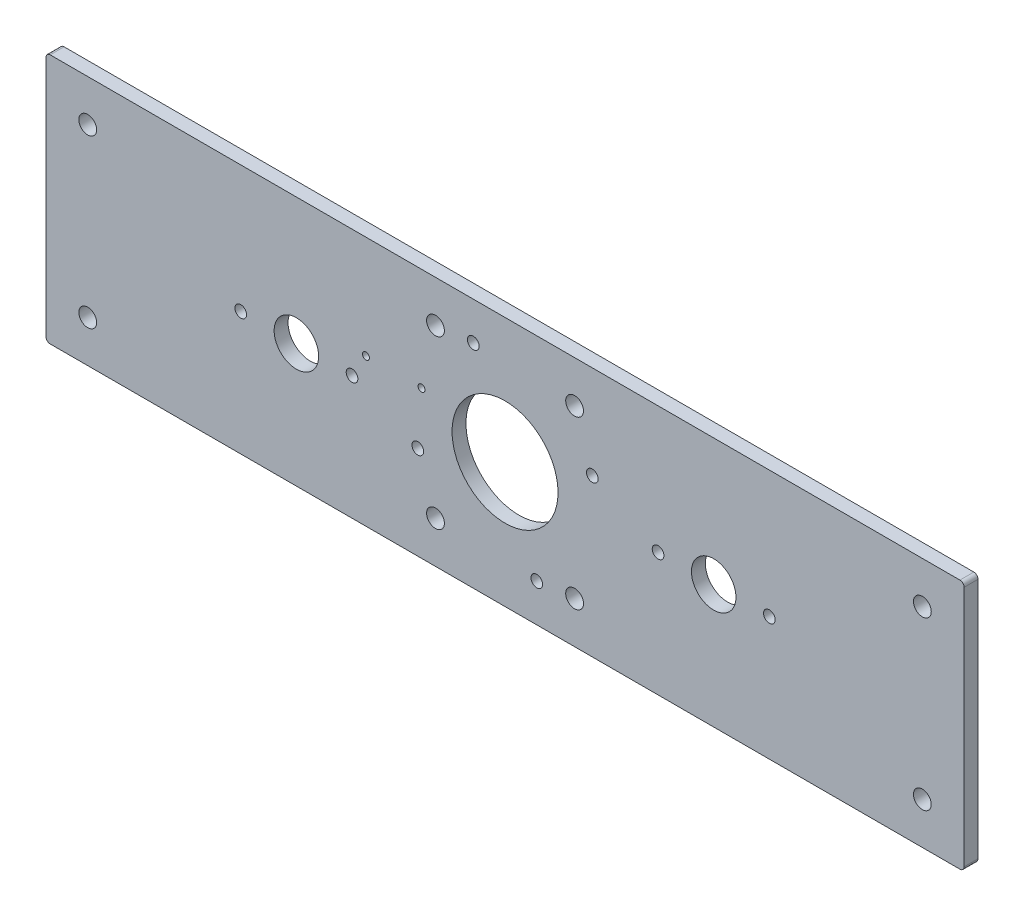
ISO-10303-21;
HEADER;
FILE_DESCRIPTION(('STEP AP214'),'2;1');
FILE_NAME('part.step','',(''),(''),'','','');
FILE_SCHEMA(('AUTOMOTIVE_DESIGN { 1 0 10303 214 1 1 1 1 }'));
ENDSEC;
DATA;
#1=APPLICATION_CONTEXT('core data for automotive mechanical design processes');
#2=APPLICATION_PROTOCOL_DEFINITION('international standard','automotive_design',2000,#1);
#3=PRODUCT_CONTEXT('',#1,'mechanical');
#4=PRODUCT('Part','Part','',(#3));
#5=PRODUCT_RELATED_PRODUCT_CATEGORY('part','',(#4));
#6=PRODUCT_DEFINITION_FORMATION('','',#4);
#7=PRODUCT_DEFINITION_CONTEXT('part definition',#1,'design');
#8=PRODUCT_DEFINITION('design','',#6,#7);
#9=PRODUCT_DEFINITION_SHAPE('','',#8);
#10=(LENGTH_UNIT() NAMED_UNIT(*) SI_UNIT(.MILLI.,.METRE.));
#11=(NAMED_UNIT(*) PLANE_ANGLE_UNIT() SI_UNIT($,.RADIAN.));
#12=(NAMED_UNIT(*) SI_UNIT($,.STERADIAN.) SOLID_ANGLE_UNIT());
#13=UNCERTAINTY_MEASURE_WITH_UNIT(LENGTH_MEASURE(1.E-05),#10,'distance_accuracy_value','');
#14=(GEOMETRIC_REPRESENTATION_CONTEXT(3) GLOBAL_UNCERTAINTY_ASSIGNED_CONTEXT((#13)) GLOBAL_UNIT_ASSIGNED_CONTEXT((#10,
#11,#12)) REPRESENTATION_CONTEXT('',''));
#15=CARTESIAN_POINT('',(0.,0.,0.));
#16=DIRECTION('',(0.,0.,1.));
#17=DIRECTION('',(1.,0.,0.));
#18=AXIS2_PLACEMENT_3D('',#15,#16,#17);
#19=CARTESIAN_POINT('',(0.,0.,2.5));
#20=DIRECTION('',(0.,0.,1.));
#21=DIRECTION('',(1.,0.,0.));
#22=AXIS2_PLACEMENT_3D('',#19,#20,#21);
#23=PLANE('',#22);
#24=CARTESIAN_POINT('',(-50.,8.,2.5));
#25=DIRECTION('',(0.,0.,1.));
#26=DIRECTION('',(1.,0.,0.));
#27=AXIS2_PLACEMENT_3D('',#24,#25,#26);
#28=CIRCLE('',#27,1.24999999999999);
#29=CARTESIAN_POINT('',(-48.75,8.,2.5));
#30=VERTEX_POINT('',#29);
#31=EDGE_CURVE('E300',#30,#30,#28,.T.);
#32=ORIENTED_EDGE('',*,*,#31,.F.);
#33=EDGE_LOOP('',(#32));
#34=FACE_BOUND('',#33,.T.);
#35=CARTESIAN_POINT('',(-30.,8.,2.5));
#36=DIRECTION('',(0.,0.,1.));
#37=DIRECTION('',(1.,0.,0.));
#38=AXIS2_PLACEMENT_3D('',#35,#36,#37);
#39=CIRCLE('',#38,1.24999999999999);
#40=CARTESIAN_POINT('',(-28.75,8.,2.5));
#41=VERTEX_POINT('',#40);
#42=EDGE_CURVE('E294',#41,#41,#39,.T.);
#43=ORIENTED_EDGE('',*,*,#42,.F.);
#44=EDGE_LOOP('',(#43));
#45=FACE_BOUND('',#44,.T.);
#46=CARTESIAN_POINT('',(-11.4150727969836,31.3626547511452,2.5));
#47=DIRECTION('',(0.,0.,1.));
#48=DIRECTION('',(1.,0.,0.));
#49=AXIS2_PLACEMENT_3D('',#46,#47,#48);
#50=CIRCLE('',#49,2.09999999999999);
#51=CARTESIAN_POINT('',(-9.31507279698358,31.3626547511452,2.5));
#52=VERTEX_POINT('',#51);
#53=EDGE_CURVE('E288',#52,#52,#50,.T.);
#54=ORIENTED_EDGE('',*,*,#53,.F.);
#55=EDGE_LOOP('',(#54));
#56=FACE_BOUND('',#55,.T.);
#57=CARTESIAN_POINT('',(11.4150727969856,-31.3626547511456,2.5));
#58=DIRECTION('',(0.,0.,1.));
#59=DIRECTION('',(1.,0.,0.));
#60=AXIS2_PLACEMENT_3D('',#57,#58,#59);
#61=CIRCLE('',#60,2.09999999999999);
#62=CARTESIAN_POINT('',(13.5150727969855,-31.3626547511456,2.5));
#63=VERTEX_POINT('',#62);
#64=EDGE_CURVE('E282',#63,#63,#61,.T.);
#65=ORIENTED_EDGE('',*,*,#64,.F.);
#66=EDGE_LOOP('',(#65));
#67=FACE_BOUND('',#66,.T.);
#68=CARTESIAN_POINT('',(-31.3626547511444,-11.4150727969848,2.5));
#69=DIRECTION('',(0.,0.,1.));
#70=DIRECTION('',(1.,0.,0.));
#71=AXIS2_PLACEMENT_3D('',#68,#69,#70);
#72=CIRCLE('',#71,2.09999999999999);
#73=CARTESIAN_POINT('',(-29.2626547511444,-11.4150727969848,2.5));
#74=VERTEX_POINT('',#73);
#75=EDGE_CURVE('E276',#74,#74,#72,.T.);
#76=ORIENTED_EDGE('',*,*,#75,.F.);
#77=EDGE_LOOP('',(#76));
#78=FACE_BOUND('',#77,.T.);
#79=CARTESIAN_POINT('',(31.3626547511464,11.4150727969844,2.5));
#80=DIRECTION('',(0.,0.,1.));
#81=DIRECTION('',(1.,0.,0.));
#82=AXIS2_PLACEMENT_3D('',#79,#80,#81);
#83=CIRCLE('',#82,2.09999999999998);
#84=CARTESIAN_POINT('',(33.4626547511464,11.4150727969844,2.5));
#85=VERTEX_POINT('',#84);
#86=EDGE_CURVE('E270',#85,#85,#83,.T.);
#87=ORIENTED_EDGE('',*,*,#86,.F.);
#88=EDGE_LOOP('',(#87));
#89=FACE_BOUND('',#88,.T.);
#90=CARTESIAN_POINT('',(95.,-0.600000000000009,2.5));
#91=DIRECTION('',(0.,0.,1.));
#92=DIRECTION('',(1.,0.,0.));
#93=AXIS2_PLACEMENT_3D('',#90,#91,#92);
#94=CIRCLE('',#93,2.09999999999999);
#95=CARTESIAN_POINT('',(97.1,-0.600000000000009,2.5));
#96=VERTEX_POINT('',#95);
#97=EDGE_CURVE('E264',#96,#96,#94,.T.);
#98=ORIENTED_EDGE('',*,*,#97,.F.);
#99=EDGE_LOOP('',(#98));
#100=FACE_BOUND('',#99,.T.);
#101=CARTESIAN_POINT('',(55.,-0.600000000000009,2.5));
#102=DIRECTION('',(0.,0.,1.));
#103=DIRECTION('',(1.,0.,0.));
#104=AXIS2_PLACEMENT_3D('',#101,#102,#103);
#105=CIRCLE('',#104,2.1);
#106=CARTESIAN_POINT('',(57.1,-0.600000000000009,2.5));
#107=VERTEX_POINT('',#106);
#108=EDGE_CURVE('E258',#107,#107,#105,.T.);
#109=ORIENTED_EDGE('',*,*,#108,.F.);
#110=EDGE_LOOP('',(#109));
#111=FACE_BOUND('',#110,.T.);
#112=CARTESIAN_POINT('',(0.,0.,2.5));
#113=DIRECTION('',(0.,0.,1.));
#114=DIRECTION('',(1.,0.,0.));
#115=AXIS2_PLACEMENT_3D('',#112,#113,#114);
#116=CIRCLE('',#115,19.0499999999999);
#117=CARTESIAN_POINT('',(19.0499999999999,0.,2.5));
#118=VERTEX_POINT('',#117);
#119=EDGE_CURVE('E133',#118,#118,#116,.T.);
#120=ORIENTED_EDGE('',*,*,#119,.F.);
#121=EDGE_LOOP('',(#120));
#122=FACE_BOUND('',#121,.T.);
#123=DIRECTION('',(0.,-1.,0.));
#124=VECTOR('',#123,1.);
#125=CARTESIAN_POINT('',(-165.,-45.,2.5));
#126=LINE('',#125,#124);
#127=CARTESIAN_POINT('',(-165.,43.5,2.5));
#128=VERTEX_POINT('',#127);
#129=CARTESIAN_POINT('',(-165.,-43.5,2.5));
#130=VERTEX_POINT('',#129);
#131=EDGE_CURVE('E138',#128,#130,#126,.T.);
#132=ORIENTED_EDGE('',*,*,#131,.T.);
#133=CARTESIAN_POINT('',(-163.5,-43.5,2.5));
#134=DIRECTION('',(0.,0.,1.));
#135=DIRECTION('',(1.,0.,0.));
#136=AXIS2_PLACEMENT_3D('',#133,#134,#135);
#137=CIRCLE('',#136,1.5);
#138=CARTESIAN_POINT('',(-163.5,-45.,2.5));
#139=VERTEX_POINT('',#138);
#140=EDGE_CURVE('E153',#130,#139,#137,.T.);
#141=ORIENTED_EDGE('',*,*,#140,.T.);
#142=DIRECTION('',(1.,0.,0.));
#143=VECTOR('',#142,1.);
#144=CARTESIAN_POINT('',(165.,-45.,2.5));
#145=LINE('',#144,#143);
#146=CARTESIAN_POINT('',(163.5,-45.,2.5));
#147=VERTEX_POINT('',#146);
#148=EDGE_CURVE('E120',#139,#147,#145,.T.);
#149=ORIENTED_EDGE('',*,*,#148,.T.);
#150=CARTESIAN_POINT('',(163.5,-43.5,2.5));
#151=DIRECTION('',(0.,0.,1.));
#152=DIRECTION('',(1.,0.,0.));
#153=AXIS2_PLACEMENT_3D('',#150,#151,#152);
#154=CIRCLE('',#153,1.5);
#155=CARTESIAN_POINT('',(165.,-43.5,2.5));
#156=VERTEX_POINT('',#155);
#157=EDGE_CURVE('E151',#147,#156,#154,.T.);
#158=ORIENTED_EDGE('',*,*,#157,.T.);
#159=DIRECTION('',(0.,1.,0.));
#160=VECTOR('',#159,1.);
#161=CARTESIAN_POINT('',(165.,-45.,2.5));
#162=LINE('',#161,#160);
#163=CARTESIAN_POINT('',(165.,43.5,2.5));
#164=VERTEX_POINT('',#163);
#165=EDGE_CURVE('E164',#156,#164,#162,.T.);
#166=ORIENTED_EDGE('',*,*,#165,.T.);
#167=CARTESIAN_POINT('',(163.5,43.5,2.5));
#168=DIRECTION('',(0.,0.,1.));
#169=DIRECTION('',(1.,0.,0.));
#170=AXIS2_PLACEMENT_3D('',#167,#168,#169);
#171=CIRCLE('',#170,1.5);
#172=CARTESIAN_POINT('',(163.5,45.,2.5));
#173=VERTEX_POINT('',#172);
#174=EDGE_CURVE('E55',#164,#173,#171,.T.);
#175=ORIENTED_EDGE('',*,*,#174,.T.);
#176=DIRECTION('',(-1.,0.,0.));
#177=VECTOR('',#176,1.);
#178=CARTESIAN_POINT('',(165.,45.,2.5));
#179=LINE('',#178,#177);
#180=CARTESIAN_POINT('',(-163.5,45.,2.5));
#181=VERTEX_POINT('',#180);
#182=EDGE_CURVE('E139',#173,#181,#179,.T.);
#183=ORIENTED_EDGE('',*,*,#182,.T.);
#184=CARTESIAN_POINT('',(-163.5,43.5,2.5));
#185=DIRECTION('',(0.,0.,1.));
#186=DIRECTION('',(1.,0.,0.));
#187=AXIS2_PLACEMENT_3D('',#184,#185,#186);
#188=CIRCLE('',#187,1.5);
#189=EDGE_CURVE('E148',#181,#128,#188,.T.);
#190=ORIENTED_EDGE('',*,*,#189,.T.);
#191=EDGE_LOOP('',(#132,#141,#149,#158,#166,#175,#183,#190));
#192=FACE_BOUND('',#191,.T.);
#193=CARTESIAN_POINT('',(-150.,-30.,2.5));
#194=DIRECTION('',(0.,0.,1.));
#195=DIRECTION('',(1.,0.,0.));
#196=AXIS2_PLACEMENT_3D('',#193,#194,#195);
#197=CIRCLE('',#196,3.19999999999998);
#198=CARTESIAN_POINT('',(-146.8,-30.,2.5));
#199=VERTEX_POINT('',#198);
#200=EDGE_CURVE('E186',#199,#199,#197,.T.);
#201=ORIENTED_EDGE('',*,*,#200,.F.);
#202=EDGE_LOOP('',(#201));
#203=FACE_BOUND('',#202,.T.);
#204=CARTESIAN_POINT('',(-25.,-30.,2.5));
#205=DIRECTION('',(0.,0.,1.));
#206=DIRECTION('',(1.,0.,0.));
#207=AXIS2_PLACEMENT_3D('',#204,#205,#206);
#208=CIRCLE('',#207,3.19999999999999);
#209=CARTESIAN_POINT('',(-21.8,-30.,2.5));
#210=VERTEX_POINT('',#209);
#211=EDGE_CURVE('E192',#210,#210,#208,.T.);
#212=ORIENTED_EDGE('',*,*,#211,.F.);
#213=EDGE_LOOP('',(#212));
#214=FACE_BOUND('',#213,.T.);
#215=CARTESIAN_POINT('',(-25.,30.,2.5));
#216=DIRECTION('',(0.,0.,1.));
#217=DIRECTION('',(1.,0.,0.));
#218=AXIS2_PLACEMENT_3D('',#215,#216,#217);
#219=CIRCLE('',#218,3.19999999999999);
#220=CARTESIAN_POINT('',(-21.8,30.,2.5));
#221=VERTEX_POINT('',#220);
#222=EDGE_CURVE('E198',#221,#221,#219,.T.);
#223=ORIENTED_EDGE('',*,*,#222,.F.);
#224=EDGE_LOOP('',(#223));
#225=FACE_BOUND('',#224,.T.);
#226=CARTESIAN_POINT('',(-150.,30.,2.5));
#227=DIRECTION('',(0.,0.,1.));
#228=DIRECTION('',(1.,0.,0.));
#229=AXIS2_PLACEMENT_3D('',#226,#227,#228);
#230=CIRCLE('',#229,3.19999999999998);
#231=CARTESIAN_POINT('',(-146.8,30.,2.5));
#232=VERTEX_POINT('',#231);
#233=EDGE_CURVE('E204',#232,#232,#230,.T.);
#234=ORIENTED_EDGE('',*,*,#233,.F.);
#235=EDGE_LOOP('',(#234));
#236=FACE_BOUND('',#235,.T.);
#237=CARTESIAN_POINT('',(150.,-30.,2.5));
#238=DIRECTION('',(0.,0.,1.));
#239=DIRECTION('',(1.,0.,0.));
#240=AXIS2_PLACEMENT_3D('',#237,#238,#239);
#241=CIRCLE('',#240,3.19999999999998);
#242=CARTESIAN_POINT('',(153.2,-30.,2.5));
#243=VERTEX_POINT('',#242);
#244=EDGE_CURVE('E210',#243,#243,#241,.T.);
#245=ORIENTED_EDGE('',*,*,#244,.F.);
#246=EDGE_LOOP('',(#245));
#247=FACE_BOUND('',#246,.T.);
#248=CARTESIAN_POINT('',(25.,-30.,2.5));
#249=DIRECTION('',(0.,0.,1.));
#250=DIRECTION('',(1.,0.,0.));
#251=AXIS2_PLACEMENT_3D('',#248,#249,#250);
#252=CIRCLE('',#251,3.19999999999999);
#253=CARTESIAN_POINT('',(28.2,-30.,2.5));
#254=VERTEX_POINT('',#253);
#255=EDGE_CURVE('E216',#254,#254,#252,.T.);
#256=ORIENTED_EDGE('',*,*,#255,.F.);
#257=EDGE_LOOP('',(#256));
#258=FACE_BOUND('',#257,.T.);
#259=CARTESIAN_POINT('',(25.,30.,2.5));
#260=DIRECTION('',(0.,0.,1.));
#261=DIRECTION('',(1.,0.,0.));
#262=AXIS2_PLACEMENT_3D('',#259,#260,#261);
#263=CIRCLE('',#262,3.19999999999999);
#264=CARTESIAN_POINT('',(28.2,30.,2.5));
#265=VERTEX_POINT('',#264);
#266=EDGE_CURVE('E222',#265,#265,#263,.T.);
#267=ORIENTED_EDGE('',*,*,#266,.F.);
#268=EDGE_LOOP('',(#267));
#269=FACE_BOUND('',#268,.T.);
#270=CARTESIAN_POINT('',(150.,30.,2.5));
#271=DIRECTION('',(0.,0.,1.));
#272=DIRECTION('',(1.,0.,0.));
#273=AXIS2_PLACEMENT_3D('',#270,#271,#272);
#274=CIRCLE('',#273,3.19999999999998);
#275=CARTESIAN_POINT('',(153.2,30.,2.5));
#276=VERTEX_POINT('',#275);
#277=EDGE_CURVE('E228',#276,#276,#274,.T.);
#278=ORIENTED_EDGE('',*,*,#277,.F.);
#279=EDGE_LOOP('',(#278));
#280=FACE_BOUND('',#279,.T.);
#281=CARTESIAN_POINT('',(-75.,-0.600000000000009,2.5));
#282=DIRECTION('',(0.,0.,1.));
#283=DIRECTION('',(1.,0.,0.));
#284=AXIS2_PLACEMENT_3D('',#281,#282,#283);
#285=CIRCLE('',#284,8.);
#286=CARTESIAN_POINT('',(-67.,-0.600000000000009,2.5));
#287=VERTEX_POINT('',#286);
#288=EDGE_CURVE('E232',#287,#287,#285,.T.);
#289=ORIENTED_EDGE('',*,*,#288,.F.);
#290=EDGE_LOOP('',(#289));
#291=FACE_BOUND('',#290,.T.);
#292=CARTESIAN_POINT('',(-55.,-0.600000000000009,2.5));
#293=DIRECTION('',(0.,0.,1.));
#294=DIRECTION('',(1.,0.,0.));
#295=AXIS2_PLACEMENT_3D('',#292,#293,#294);
#296=CIRCLE('',#295,2.1);
#297=CARTESIAN_POINT('',(-52.9,-0.600000000000009,2.5));
#298=VERTEX_POINT('',#297);
#299=EDGE_CURVE('E240',#298,#298,#296,.T.);
#300=ORIENTED_EDGE('',*,*,#299,.F.);
#301=EDGE_LOOP('',(#300));
#302=FACE_BOUND('',#301,.T.);
#303=CARTESIAN_POINT('',(-95.,-0.600000000000009,2.5));
#304=DIRECTION('',(0.,0.,1.));
#305=DIRECTION('',(1.,0.,0.));
#306=AXIS2_PLACEMENT_3D('',#303,#304,#305);
#307=CIRCLE('',#306,2.09999999999999);
#308=CARTESIAN_POINT('',(-92.9,-0.600000000000009,2.5));
#309=VERTEX_POINT('',#308);
#310=EDGE_CURVE('E246',#309,#309,#307,.T.);
#311=ORIENTED_EDGE('',*,*,#310,.F.);
#312=EDGE_LOOP('',(#311));
#313=FACE_BOUND('',#312,.T.);
#314=CARTESIAN_POINT('',(75.,-0.600000000000009,2.5));
#315=DIRECTION('',(0.,0.,-1.));
#316=DIRECTION('',(-1.,0.,0.));
#317=AXIS2_PLACEMENT_3D('',#314,#315,#316);
#318=CIRCLE('',#317,8.);
#319=CARTESIAN_POINT('',(67.,-0.600000000000009,2.5));
#320=VERTEX_POINT('',#319);
#321=EDGE_CURVE('E250',#320,#320,#318,.T.);
#322=ORIENTED_EDGE('',*,*,#321,.T.);
#323=EDGE_LOOP('',(#322));
#324=FACE_BOUND('',#323,.T.);
#325=ADVANCED_FACE('F34',(#34,#45,#56,#67,#78,#89,#100,#111,#122,#192,#203,#214,#225,#236,#247,
#258,#269,#280,#291,#302,#313,#324),#23,.T.);
#326=CARTESIAN_POINT('',(0.,0.,-2.5));
#327=DIRECTION('',(0.,0.,1.));
#328=DIRECTION('',(1.,0.,0.));
#329=AXIS2_PLACEMENT_3D('',#326,#327,#328);
#330=PLANE('',#329);
#331=CARTESIAN_POINT('',(-50.,8.,-2.5));
#332=DIRECTION('',(0.,0.,1.));
#333=DIRECTION('',(1.,0.,0.));
#334=AXIS2_PLACEMENT_3D('',#331,#332,#333);
#335=CIRCLE('',#334,1.25);
#336=CARTESIAN_POINT('',(-48.75,8.,-2.5));
#337=VERTEX_POINT('',#336);
#338=EDGE_CURVE('E297',#337,#337,#335,.T.);
#339=ORIENTED_EDGE('',*,*,#338,.T.);
#340=EDGE_LOOP('',(#339));
#341=FACE_BOUND('',#340,.T.);
#342=CARTESIAN_POINT('',(-30.,8.,-2.5));
#343=DIRECTION('',(0.,0.,1.));
#344=DIRECTION('',(1.,0.,0.));
#345=AXIS2_PLACEMENT_3D('',#342,#343,#344);
#346=CIRCLE('',#345,1.25);
#347=CARTESIAN_POINT('',(-28.75,8.,-2.5));
#348=VERTEX_POINT('',#347);
#349=EDGE_CURVE('E291',#348,#348,#346,.T.);
#350=ORIENTED_EDGE('',*,*,#349,.T.);
#351=EDGE_LOOP('',(#350));
#352=FACE_BOUND('',#351,.T.);
#353=CARTESIAN_POINT('',(-11.4150727969836,31.3626547511452,-2.5));
#354=DIRECTION('',(0.,0.,1.));
#355=DIRECTION('',(1.,0.,0.));
#356=AXIS2_PLACEMENT_3D('',#353,#354,#355);
#357=CIRCLE('',#356,2.1);
#358=CARTESIAN_POINT('',(-9.31507279698357,31.3626547511452,-2.5));
#359=VERTEX_POINT('',#358);
#360=EDGE_CURVE('E285',#359,#359,#357,.T.);
#361=ORIENTED_EDGE('',*,*,#360,.T.);
#362=EDGE_LOOP('',(#361));
#363=FACE_BOUND('',#362,.T.);
#364=CARTESIAN_POINT('',(11.4150727969856,-31.3626547511456,-2.5));
#365=DIRECTION('',(0.,0.,1.));
#366=DIRECTION('',(1.,0.,0.));
#367=AXIS2_PLACEMENT_3D('',#364,#365,#366);
#368=CIRCLE('',#367,2.1);
#369=CARTESIAN_POINT('',(13.5150727969856,-31.3626547511456,-2.5));
#370=VERTEX_POINT('',#369);
#371=EDGE_CURVE('E279',#370,#370,#368,.T.);
#372=ORIENTED_EDGE('',*,*,#371,.T.);
#373=EDGE_LOOP('',(#372));
#374=FACE_BOUND('',#373,.T.);
#375=CARTESIAN_POINT('',(-31.3626547511444,-11.4150727969848,-2.5));
#376=DIRECTION('',(0.,0.,1.));
#377=DIRECTION('',(1.,0.,0.));
#378=AXIS2_PLACEMENT_3D('',#375,#376,#377);
#379=CIRCLE('',#378,2.1);
#380=CARTESIAN_POINT('',(-29.2626547511444,-11.4150727969848,-2.5));
#381=VERTEX_POINT('',#380);
#382=EDGE_CURVE('E273',#381,#381,#379,.T.);
#383=ORIENTED_EDGE('',*,*,#382,.T.);
#384=EDGE_LOOP('',(#383));
#385=FACE_BOUND('',#384,.T.);
#386=CARTESIAN_POINT('',(31.3626547511464,11.4150727969844,-2.5));
#387=DIRECTION('',(0.,0.,1.));
#388=DIRECTION('',(1.,0.,0.));
#389=AXIS2_PLACEMENT_3D('',#386,#387,#388);
#390=CIRCLE('',#389,2.1);
#391=CARTESIAN_POINT('',(33.4626547511464,11.4150727969844,-2.5));
#392=VERTEX_POINT('',#391);
#393=EDGE_CURVE('E267',#392,#392,#390,.T.);
#394=ORIENTED_EDGE('',*,*,#393,.T.);
#395=EDGE_LOOP('',(#394));
#396=FACE_BOUND('',#395,.T.);
#397=CARTESIAN_POINT('',(95.,-0.600000000000009,-2.5));
#398=DIRECTION('',(0.,0.,1.));
#399=DIRECTION('',(1.,0.,0.));
#400=AXIS2_PLACEMENT_3D('',#397,#398,#399);
#401=CIRCLE('',#400,2.09999999999999);
#402=CARTESIAN_POINT('',(97.1,-0.600000000000009,-2.5));
#403=VERTEX_POINT('',#402);
#404=EDGE_CURVE('E261',#403,#403,#401,.T.);
#405=ORIENTED_EDGE('',*,*,#404,.T.);
#406=EDGE_LOOP('',(#405));
#407=FACE_BOUND('',#406,.T.);
#408=CARTESIAN_POINT('',(55.,-0.600000000000009,-2.5));
#409=DIRECTION('',(0.,0.,1.));
#410=DIRECTION('',(1.,0.,0.));
#411=AXIS2_PLACEMENT_3D('',#408,#409,#410);
#412=CIRCLE('',#411,2.1);
#413=CARTESIAN_POINT('',(57.1,-0.600000000000009,-2.5));
#414=VERTEX_POINT('',#413);
#415=EDGE_CURVE('E253',#414,#414,#412,.T.);
#416=ORIENTED_EDGE('',*,*,#415,.T.);
#417=EDGE_LOOP('',(#416));
#418=FACE_BOUND('',#417,.T.);
#419=CARTESIAN_POINT('',(0.,0.,-2.5));
#420=DIRECTION('',(0.,0.,1.));
#421=DIRECTION('',(1.,0.,0.));
#422=AXIS2_PLACEMENT_3D('',#419,#420,#421);
#423=CIRCLE('',#422,19.0499999999999);
#424=CARTESIAN_POINT('',(19.0499999999999,0.,-2.5));
#425=VERTEX_POINT('',#424);
#426=EDGE_CURVE('E178',#425,#425,#423,.T.);
#427=ORIENTED_EDGE('',*,*,#426,.T.);
#428=EDGE_LOOP('',(#427));
#429=FACE_BOUND('',#428,.T.);
#430=DIRECTION('',(1.,0.,0.));
#431=VECTOR('',#430,1.);
#432=CARTESIAN_POINT('',(165.,-45.,-2.5));
#433=LINE('',#432,#431);
#434=CARTESIAN_POINT('',(-163.5,-45.,-2.5));
#435=VERTEX_POINT('',#434);
#436=CARTESIAN_POINT('',(163.5,-45.,-2.5));
#437=VERTEX_POINT('',#436);
#438=EDGE_CURVE('E117',#435,#437,#433,.T.);
#439=ORIENTED_EDGE('',*,*,#438,.F.);
#440=CARTESIAN_POINT('',(-163.5,-43.5,-2.5));
#441=DIRECTION('',(0.,0.,1.));
#442=DIRECTION('',(1.,0.,0.));
#443=AXIS2_PLACEMENT_3D('',#440,#441,#442);
#444=CIRCLE('',#443,1.5);
#445=CARTESIAN_POINT('',(-165.,-43.5,-2.5));
#446=VERTEX_POINT('',#445);
#447=EDGE_CURVE('E100',#435,#446,#444,.F.);
#448=ORIENTED_EDGE('',*,*,#447,.T.);
#449=DIRECTION('',(0.,-1.,0.));
#450=VECTOR('',#449,1.);
#451=CARTESIAN_POINT('',(-165.,-45.,-2.5));
#452=LINE('',#451,#450);
#453=CARTESIAN_POINT('',(-165.,43.5,-2.5));
#454=VERTEX_POINT('',#453);
#455=EDGE_CURVE('E128',#454,#446,#452,.T.);
#456=ORIENTED_EDGE('',*,*,#455,.F.);
#457=CARTESIAN_POINT('',(-163.5,43.5,-2.5));
#458=DIRECTION('',(0.,0.,1.));
#459=DIRECTION('',(1.,0.,0.));
#460=AXIS2_PLACEMENT_3D('',#457,#458,#459);
#461=CIRCLE('',#460,1.5);
#462=CARTESIAN_POINT('',(-163.5,45.,-2.5));
#463=VERTEX_POINT('',#462);
#464=EDGE_CURVE('E121',#454,#463,#461,.F.);
#465=ORIENTED_EDGE('',*,*,#464,.T.);
#466=DIRECTION('',(-1.,0.,0.));
#467=VECTOR('',#466,1.);
#468=CARTESIAN_POINT('',(165.,45.,-2.5));
#469=LINE('',#468,#467);
#470=CARTESIAN_POINT('',(163.5,45.,-2.5));
#471=VERTEX_POINT('',#470);
#472=EDGE_CURVE('E131',#471,#463,#469,.T.);
#473=ORIENTED_EDGE('',*,*,#472,.F.);
#474=CARTESIAN_POINT('',(163.5,43.5,-2.5));
#475=DIRECTION('',(0.,0.,1.));
#476=DIRECTION('',(1.,0.,0.));
#477=AXIS2_PLACEMENT_3D('',#474,#475,#476);
#478=CIRCLE('',#477,1.5);
#479=CARTESIAN_POINT('',(165.,43.5,-2.5));
#480=VERTEX_POINT('',#479);
#481=EDGE_CURVE('E142',#471,#480,#478,.F.);
#482=ORIENTED_EDGE('',*,*,#481,.T.);
#483=DIRECTION('',(0.,1.,0.));
#484=VECTOR('',#483,1.);
#485=CARTESIAN_POINT('',(165.,-45.,-2.5));
#486=LINE('',#485,#484);
#487=CARTESIAN_POINT('',(165.,-43.5,-2.5));
#488=VERTEX_POINT('',#487);
#489=EDGE_CURVE('E127',#488,#480,#486,.T.);
#490=ORIENTED_EDGE('',*,*,#489,.F.);
#491=CARTESIAN_POINT('',(163.5,-43.5,-2.5));
#492=DIRECTION('',(0.,0.,1.));
#493=DIRECTION('',(1.,0.,0.));
#494=AXIS2_PLACEMENT_3D('',#491,#492,#493);
#495=CIRCLE('',#494,1.5);
#496=EDGE_CURVE('E111',#488,#437,#495,.F.);
#497=ORIENTED_EDGE('',*,*,#496,.T.);
#498=EDGE_LOOP('',(#439,#448,#456,#465,#473,#482,#490,#497));
#499=FACE_BOUND('',#498,.T.);
#500=CARTESIAN_POINT('',(-150.,-30.,-2.5));
#501=DIRECTION('',(0.,0.,1.));
#502=DIRECTION('',(1.,0.,0.));
#503=AXIS2_PLACEMENT_3D('',#500,#501,#502);
#504=CIRCLE('',#503,3.20000000000001);
#505=CARTESIAN_POINT('',(-146.8,-30.,-2.5));
#506=VERTEX_POINT('',#505);
#507=EDGE_CURVE('E181',#506,#506,#504,.T.);
#508=ORIENTED_EDGE('',*,*,#507,.T.);
#509=EDGE_LOOP('',(#508));
#510=FACE_BOUND('',#509,.T.);
#511=CARTESIAN_POINT('',(-25.,-30.,-2.5));
#512=DIRECTION('',(0.,0.,1.));
#513=DIRECTION('',(1.,0.,0.));
#514=AXIS2_PLACEMENT_3D('',#511,#512,#513);
#515=CIRCLE('',#514,3.2);
#516=CARTESIAN_POINT('',(-21.8,-30.,-2.5));
#517=VERTEX_POINT('',#516);
#518=EDGE_CURVE('E189',#517,#517,#515,.T.);
#519=ORIENTED_EDGE('',*,*,#518,.T.);
#520=EDGE_LOOP('',(#519));
#521=FACE_BOUND('',#520,.T.);
#522=CARTESIAN_POINT('',(-25.,30.,-2.5));
#523=DIRECTION('',(0.,0.,1.));
#524=DIRECTION('',(1.,0.,0.));
#525=AXIS2_PLACEMENT_3D('',#522,#523,#524);
#526=CIRCLE('',#525,3.2);
#527=CARTESIAN_POINT('',(-21.8,30.,-2.5));
#528=VERTEX_POINT('',#527);
#529=EDGE_CURVE('E195',#528,#528,#526,.T.);
#530=ORIENTED_EDGE('',*,*,#529,.T.);
#531=EDGE_LOOP('',(#530));
#532=FACE_BOUND('',#531,.T.);
#533=CARTESIAN_POINT('',(-150.,30.,-2.5));
#534=DIRECTION('',(0.,0.,1.));
#535=DIRECTION('',(1.,0.,0.));
#536=AXIS2_PLACEMENT_3D('',#533,#534,#535);
#537=CIRCLE('',#536,3.20000000000001);
#538=CARTESIAN_POINT('',(-146.8,30.,-2.5));
#539=VERTEX_POINT('',#538);
#540=EDGE_CURVE('E201',#539,#539,#537,.T.);
#541=ORIENTED_EDGE('',*,*,#540,.T.);
#542=EDGE_LOOP('',(#541));
#543=FACE_BOUND('',#542,.T.);
#544=CARTESIAN_POINT('',(150.,-30.,-2.5));
#545=DIRECTION('',(0.,0.,1.));
#546=DIRECTION('',(1.,0.,0.));
#547=AXIS2_PLACEMENT_3D('',#544,#545,#546);
#548=CIRCLE('',#547,3.20000000000001);
#549=CARTESIAN_POINT('',(153.2,-30.,-2.5));
#550=VERTEX_POINT('',#549);
#551=EDGE_CURVE('E207',#550,#550,#548,.T.);
#552=ORIENTED_EDGE('',*,*,#551,.T.);
#553=EDGE_LOOP('',(#552));
#554=FACE_BOUND('',#553,.T.);
#555=CARTESIAN_POINT('',(25.,-30.,-2.5));
#556=DIRECTION('',(0.,0.,1.));
#557=DIRECTION('',(1.,0.,0.));
#558=AXIS2_PLACEMENT_3D('',#555,#556,#557);
#559=CIRCLE('',#558,3.2);
#560=CARTESIAN_POINT('',(28.2,-30.,-2.5));
#561=VERTEX_POINT('',#560);
#562=EDGE_CURVE('E213',#561,#561,#559,.T.);
#563=ORIENTED_EDGE('',*,*,#562,.T.);
#564=EDGE_LOOP('',(#563));
#565=FACE_BOUND('',#564,.T.);
#566=CARTESIAN_POINT('',(25.,30.,-2.5));
#567=DIRECTION('',(0.,0.,1.));
#568=DIRECTION('',(1.,0.,0.));
#569=AXIS2_PLACEMENT_3D('',#566,#567,#568);
#570=CIRCLE('',#569,3.2);
#571=CARTESIAN_POINT('',(28.2,30.,-2.5));
#572=VERTEX_POINT('',#571);
#573=EDGE_CURVE('E219',#572,#572,#570,.T.);
#574=ORIENTED_EDGE('',*,*,#573,.T.);
#575=EDGE_LOOP('',(#574));
#576=FACE_BOUND('',#575,.T.);
#577=CARTESIAN_POINT('',(150.,30.,-2.5));
#578=DIRECTION('',(0.,0.,1.));
#579=DIRECTION('',(1.,0.,0.));
#580=AXIS2_PLACEMENT_3D('',#577,#578,#579);
#581=CIRCLE('',#580,3.20000000000001);
#582=CARTESIAN_POINT('',(153.2,30.,-2.5));
#583=VERTEX_POINT('',#582);
#584=EDGE_CURVE('E225',#583,#583,#581,.T.);
#585=ORIENTED_EDGE('',*,*,#584,.T.);
#586=EDGE_LOOP('',(#585));
#587=FACE_BOUND('',#586,.T.);
#588=CARTESIAN_POINT('',(-75.,-0.600000000000009,-2.5));
#589=DIRECTION('',(0.,0.,1.));
#590=DIRECTION('',(1.,0.,0.));
#591=AXIS2_PLACEMENT_3D('',#588,#589,#590);
#592=CIRCLE('',#591,8.);
#593=CARTESIAN_POINT('',(-67.,-0.600000000000009,-2.5));
#594=VERTEX_POINT('',#593);
#595=EDGE_CURVE('E231',#594,#594,#592,.T.);
#596=ORIENTED_EDGE('',*,*,#595,.T.);
#597=EDGE_LOOP('',(#596));
#598=FACE_BOUND('',#597,.T.);
#599=CARTESIAN_POINT('',(-55.,-0.600000000000009,-2.5));
#600=DIRECTION('',(0.,0.,1.));
#601=DIRECTION('',(1.,0.,0.));
#602=AXIS2_PLACEMENT_3D('',#599,#600,#601);
#603=CIRCLE('',#602,2.1);
#604=CARTESIAN_POINT('',(-52.9,-0.600000000000009,-2.5));
#605=VERTEX_POINT('',#604);
#606=EDGE_CURVE('E235',#605,#605,#603,.T.);
#607=ORIENTED_EDGE('',*,*,#606,.T.);
#608=EDGE_LOOP('',(#607));
#609=FACE_BOUND('',#608,.T.);
#610=CARTESIAN_POINT('',(-95.,-0.600000000000009,-2.5));
#611=DIRECTION('',(0.,0.,1.));
#612=DIRECTION('',(1.,0.,0.));
#613=AXIS2_PLACEMENT_3D('',#610,#611,#612);
#614=CIRCLE('',#613,2.09999999999999);
#615=CARTESIAN_POINT('',(-92.9,-0.600000000000009,-2.5));
#616=VERTEX_POINT('',#615);
#617=EDGE_CURVE('E243',#616,#616,#614,.T.);
#618=ORIENTED_EDGE('',*,*,#617,.T.);
#619=EDGE_LOOP('',(#618));
#620=FACE_BOUND('',#619,.T.);
#621=CARTESIAN_POINT('',(75.,-0.600000000000009,-2.5));
#622=DIRECTION('',(0.,0.,-1.));
#623=DIRECTION('',(-1.,0.,0.));
#624=AXIS2_PLACEMENT_3D('',#621,#622,#623);
#625=CIRCLE('',#624,8.);
#626=CARTESIAN_POINT('',(67.,-0.600000000000009,-2.5));
#627=VERTEX_POINT('',#626);
#628=EDGE_CURVE('E249',#627,#627,#625,.T.);
#629=ORIENTED_EDGE('',*,*,#628,.F.);
#630=EDGE_LOOP('',(#629));
#631=FACE_BOUND('',#630,.T.);
#632=ADVANCED_FACE('F124',(#341,#352,#363,#374,#385,#396,#407,#418,#429,#499,#510,#521,#532,
#543,#554,#565,#576,#587,#598,#609,#620,#631),#330,.F.);
#633=CARTESIAN_POINT('',(-165.,-45.,2.5));
#634=DIRECTION('',(1.,0.,0.));
#635=DIRECTION('',(0.,0.,-1.));
#636=AXIS2_PLACEMENT_3D('',#633,#634,#635);
#637=PLANE('',#636);
#638=ORIENTED_EDGE('',*,*,#455,.T.);
#639=DIRECTION('',(0.,0.,-1.));
#640=VECTOR('',#639,1.);
#641=CARTESIAN_POINT('',(-165.,-43.5,2.5));
#642=LINE('',#641,#640);
#643=EDGE_CURVE('E105',#446,#130,#642,.F.);
#644=ORIENTED_EDGE('',*,*,#643,.T.);
#645=ORIENTED_EDGE('',*,*,#131,.F.);
#646=DIRECTION('',(0.,0.,-1.));
#647=VECTOR('',#646,1.);
#648=CARTESIAN_POINT('',(-165.,43.5,2.5));
#649=LINE('',#648,#647);
#650=EDGE_CURVE('E110',#128,#454,#649,.T.);
#651=ORIENTED_EDGE('',*,*,#650,.T.);
#652=EDGE_LOOP('',(#638,#644,#645,#651));
#653=FACE_BOUND('',#652,.T.);
#654=ADVANCED_FACE('F413',(#653),#637,.F.);
#655=CARTESIAN_POINT('',(165.,-45.,2.5));
#656=DIRECTION('',(0.,1.,0.));
#657=DIRECTION('',(-1.,0.,0.));
#658=AXIS2_PLACEMENT_3D('',#655,#656,#657);
#659=PLANE('',#658);
#660=ORIENTED_EDGE('',*,*,#148,.F.);
#661=DIRECTION('',(0.,0.,-1.));
#662=VECTOR('',#661,1.);
#663=CARTESIAN_POINT('',(-163.5,-45.,2.5));
#664=LINE('',#663,#662);
#665=EDGE_CURVE('E104',#139,#435,#664,.T.);
#666=ORIENTED_EDGE('',*,*,#665,.T.);
#667=ORIENTED_EDGE('',*,*,#438,.T.);
#668=DIRECTION('',(0.,0.,-1.));
#669=VECTOR('',#668,1.);
#670=CARTESIAN_POINT('',(163.5,-45.,2.5));
#671=LINE('',#670,#669);
#672=EDGE_CURVE('E122',#437,#147,#671,.F.);
#673=ORIENTED_EDGE('',*,*,#672,.T.);
#674=EDGE_LOOP('',(#660,#666,#667,#673));
#675=FACE_BOUND('',#674,.T.);
#676=ADVANCED_FACE('F116',(#675),#659,.F.);
#677=CARTESIAN_POINT('',(165.,-45.,2.5));
#678=DIRECTION('',(-1.,0.,0.));
#679=DIRECTION('',(0.,0.,1.));
#680=AXIS2_PLACEMENT_3D('',#677,#678,#679);
#681=PLANE('',#680);
#682=ORIENTED_EDGE('',*,*,#165,.F.);
#683=DIRECTION('',(0.,0.,-1.));
#684=VECTOR('',#683,1.);
#685=CARTESIAN_POINT('',(165.,-43.5,2.5));
#686=LINE('',#685,#684);
#687=EDGE_CURVE('E157',#156,#488,#686,.T.);
#688=ORIENTED_EDGE('',*,*,#687,.T.);
#689=ORIENTED_EDGE('',*,*,#489,.T.);
#690=DIRECTION('',(0.,0.,-1.));
#691=VECTOR('',#690,1.);
#692=CARTESIAN_POINT('',(165.,43.5,2.5));
#693=LINE('',#692,#691);
#694=EDGE_CURVE('E155',#480,#164,#693,.F.);
#695=ORIENTED_EDGE('',*,*,#694,.T.);
#696=EDGE_LOOP('',(#682,#688,#689,#695));
#697=FACE_BOUND('',#696,.T.);
#698=ADVANCED_FACE('F162',(#697),#681,.F.);
#699=CARTESIAN_POINT('',(165.,45.,2.5));
#700=DIRECTION('',(0.,-1.,0.));
#701=DIRECTION('',(1.,0.,0.));
#702=AXIS2_PLACEMENT_3D('',#699,#700,#701);
#703=PLANE('',#702);
#704=ORIENTED_EDGE('',*,*,#182,.F.);
#705=DIRECTION('',(0.,0.,-1.));
#706=VECTOR('',#705,1.);
#707=CARTESIAN_POINT('',(163.5,45.,2.5));
#708=LINE('',#707,#706);
#709=EDGE_CURVE('E11',#173,#471,#708,.T.);
#710=ORIENTED_EDGE('',*,*,#709,.T.);
#711=ORIENTED_EDGE('',*,*,#472,.T.);
#712=DIRECTION('',(0.,0.,-1.));
#713=VECTOR('',#712,1.);
#714=CARTESIAN_POINT('',(-163.5,45.,2.5));
#715=LINE('',#714,#713);
#716=EDGE_CURVE('E42',#463,#181,#715,.F.);
#717=ORIENTED_EDGE('',*,*,#716,.T.);
#718=EDGE_LOOP('',(#704,#710,#711,#717));
#719=FACE_BOUND('',#718,.T.);
#720=ADVANCED_FACE('F171',(#719),#703,.F.);
#721=CARTESIAN_POINT('',(0.,0.,2.5));
#722=DIRECTION('',(0.,0.,-1.));
#723=DIRECTION('',(-1.,0.,0.));
#724=AXIS2_PLACEMENT_3D('',#721,#722,#723);
#725=CYLINDRICAL_SURFACE('',#724,19.0499999999999);
#726=ORIENTED_EDGE('',*,*,#119,.T.);
#727=EDGE_LOOP('',(#726));
#728=FACE_BOUND('',#727,.T.);
#729=ORIENTED_EDGE('',*,*,#426,.F.);
#730=EDGE_LOOP('',(#729));
#731=FACE_BOUND('',#730,.T.);
#732=ADVANCED_FACE('F406',(#728,#731),#725,.F.);
#733=CARTESIAN_POINT('',(-150.,-30.,2.5));
#734=DIRECTION('',(0.,0.,1.));
#735=DIRECTION('',(1.,0.,0.));
#736=AXIS2_PLACEMENT_3D('',#733,#734,#735);
#737=CYLINDRICAL_SURFACE('',#736,3.19999999999999);
#738=ORIENTED_EDGE('',*,*,#507,.F.);
#739=EDGE_LOOP('',(#738));
#740=FACE_BOUND('',#739,.T.);
#741=ORIENTED_EDGE('',*,*,#200,.T.);
#742=EDGE_LOOP('',(#741));
#743=FACE_BOUND('',#742,.T.);
#744=ADVANCED_FACE('F402',(#740,#743),#737,.F.);
#745=CARTESIAN_POINT('',(-25.,-30.,2.5));
#746=DIRECTION('',(0.,0.,1.));
#747=DIRECTION('',(1.,0.,0.));
#748=AXIS2_PLACEMENT_3D('',#745,#746,#747);
#749=CYLINDRICAL_SURFACE('',#748,3.19999999999999);
#750=ORIENTED_EDGE('',*,*,#518,.F.);
#751=EDGE_LOOP('',(#750));
#752=FACE_BOUND('',#751,.T.);
#753=ORIENTED_EDGE('',*,*,#211,.T.);
#754=EDGE_LOOP('',(#753));
#755=FACE_BOUND('',#754,.T.);
#756=ADVANCED_FACE('F398',(#752,#755),#749,.F.);
#757=CARTESIAN_POINT('',(-25.,30.,2.5));
#758=DIRECTION('',(0.,0.,1.));
#759=DIRECTION('',(1.,0.,0.));
#760=AXIS2_PLACEMENT_3D('',#757,#758,#759);
#761=CYLINDRICAL_SURFACE('',#760,3.19999999999999);
#762=ORIENTED_EDGE('',*,*,#529,.F.);
#763=EDGE_LOOP('',(#762));
#764=FACE_BOUND('',#763,.T.);
#765=ORIENTED_EDGE('',*,*,#222,.T.);
#766=EDGE_LOOP('',(#765));
#767=FACE_BOUND('',#766,.T.);
#768=ADVANCED_FACE('F394',(#764,#767),#761,.F.);
#769=CARTESIAN_POINT('',(-150.,30.,2.5));
#770=DIRECTION('',(0.,0.,1.));
#771=DIRECTION('',(1.,0.,0.));
#772=AXIS2_PLACEMENT_3D('',#769,#770,#771);
#773=CYLINDRICAL_SURFACE('',#772,3.19999999999999);
#774=ORIENTED_EDGE('',*,*,#540,.F.);
#775=EDGE_LOOP('',(#774));
#776=FACE_BOUND('',#775,.T.);
#777=ORIENTED_EDGE('',*,*,#233,.T.);
#778=EDGE_LOOP('',(#777));
#779=FACE_BOUND('',#778,.T.);
#780=ADVANCED_FACE('F390',(#776,#779),#773,.F.);
#781=CARTESIAN_POINT('',(150.,-30.,2.5));
#782=DIRECTION('',(0.,0.,1.));
#783=DIRECTION('',(1.,0.,0.));
#784=AXIS2_PLACEMENT_3D('',#781,#782,#783);
#785=CYLINDRICAL_SURFACE('',#784,3.19999999999999);
#786=ORIENTED_EDGE('',*,*,#551,.F.);
#787=EDGE_LOOP('',(#786));
#788=FACE_BOUND('',#787,.T.);
#789=ORIENTED_EDGE('',*,*,#244,.T.);
#790=EDGE_LOOP('',(#789));
#791=FACE_BOUND('',#790,.T.);
#792=ADVANCED_FACE('F386',(#788,#791),#785,.F.);
#793=CARTESIAN_POINT('',(25.,-30.,2.5));
#794=DIRECTION('',(0.,0.,1.));
#795=DIRECTION('',(1.,0.,0.));
#796=AXIS2_PLACEMENT_3D('',#793,#794,#795);
#797=CYLINDRICAL_SURFACE('',#796,3.19999999999999);
#798=ORIENTED_EDGE('',*,*,#562,.F.);
#799=EDGE_LOOP('',(#798));
#800=FACE_BOUND('',#799,.T.);
#801=ORIENTED_EDGE('',*,*,#255,.T.);
#802=EDGE_LOOP('',(#801));
#803=FACE_BOUND('',#802,.T.);
#804=ADVANCED_FACE('F382',(#800,#803),#797,.F.);
#805=CARTESIAN_POINT('',(25.,30.,2.5));
#806=DIRECTION('',(0.,0.,1.));
#807=DIRECTION('',(1.,0.,0.));
#808=AXIS2_PLACEMENT_3D('',#805,#806,#807);
#809=CYLINDRICAL_SURFACE('',#808,3.19999999999999);
#810=ORIENTED_EDGE('',*,*,#573,.F.);
#811=EDGE_LOOP('',(#810));
#812=FACE_BOUND('',#811,.T.);
#813=ORIENTED_EDGE('',*,*,#266,.T.);
#814=EDGE_LOOP('',(#813));
#815=FACE_BOUND('',#814,.T.);
#816=ADVANCED_FACE('F378',(#812,#815),#809,.F.);
#817=CARTESIAN_POINT('',(150.,30.,2.5));
#818=DIRECTION('',(0.,0.,1.));
#819=DIRECTION('',(1.,0.,0.));
#820=AXIS2_PLACEMENT_3D('',#817,#818,#819);
#821=CYLINDRICAL_SURFACE('',#820,3.19999999999999);
#822=ORIENTED_EDGE('',*,*,#584,.F.);
#823=EDGE_LOOP('',(#822));
#824=FACE_BOUND('',#823,.T.);
#825=ORIENTED_EDGE('',*,*,#277,.T.);
#826=EDGE_LOOP('',(#825));
#827=FACE_BOUND('',#826,.T.);
#828=ADVANCED_FACE('F374',(#824,#827),#821,.F.);
#829=CARTESIAN_POINT('',(-75.,-0.600000000000009,-2.5));
#830=DIRECTION('',(0.,0.,1.));
#831=DIRECTION('',(1.,0.,0.));
#832=AXIS2_PLACEMENT_3D('',#829,#830,#831);
#833=CYLINDRICAL_SURFACE('',#832,8.);
#834=ORIENTED_EDGE('',*,*,#595,.F.);
#835=EDGE_LOOP('',(#834));
#836=FACE_BOUND('',#835,.T.);
#837=ORIENTED_EDGE('',*,*,#288,.T.);
#838=EDGE_LOOP('',(#837));
#839=FACE_BOUND('',#838,.T.);
#840=ADVANCED_FACE('F370',(#836,#839),#833,.F.);
#841=CARTESIAN_POINT('',(-55.,-0.600000000000009,2.5));
#842=DIRECTION('',(0.,0.,1.));
#843=DIRECTION('',(1.,0.,0.));
#844=AXIS2_PLACEMENT_3D('',#841,#842,#843);
#845=CYLINDRICAL_SURFACE('',#844,2.1);
#846=ORIENTED_EDGE('',*,*,#606,.F.);
#847=EDGE_LOOP('',(#846));
#848=FACE_BOUND('',#847,.T.);
#849=ORIENTED_EDGE('',*,*,#299,.T.);
#850=EDGE_LOOP('',(#849));
#851=FACE_BOUND('',#850,.T.);
#852=ADVANCED_FACE('F363',(#848,#851),#845,.F.);
#853=CARTESIAN_POINT('',(-95.,-0.600000000000009,2.5));
#854=DIRECTION('',(0.,0.,1.));
#855=DIRECTION('',(1.,0.,0.));
#856=AXIS2_PLACEMENT_3D('',#853,#854,#855);
#857=CYLINDRICAL_SURFACE('',#856,2.09999999999999);
#858=ORIENTED_EDGE('',*,*,#617,.F.);
#859=EDGE_LOOP('',(#858));
#860=FACE_BOUND('',#859,.T.);
#861=ORIENTED_EDGE('',*,*,#310,.T.);
#862=EDGE_LOOP('',(#861));
#863=FACE_BOUND('',#862,.T.);
#864=ADVANCED_FACE('F353',(#860,#863),#857,.F.);
#865=CARTESIAN_POINT('',(75.,-0.600000000000009,-2.5));
#866=DIRECTION('',(0.,0.,1.));
#867=DIRECTION('',(1.,0.,0.));
#868=AXIS2_PLACEMENT_3D('',#865,#866,#867);
#869=CYLINDRICAL_SURFACE('',#868,8.);
#870=ORIENTED_EDGE('',*,*,#628,.T.);
#871=EDGE_LOOP('',(#870));
#872=FACE_BOUND('',#871,.T.);
#873=ORIENTED_EDGE('',*,*,#321,.F.);
#874=EDGE_LOOP('',(#873));
#875=FACE_BOUND('',#874,.T.);
#876=ADVANCED_FACE('F350',(#872,#875),#869,.F.);
#877=CARTESIAN_POINT('',(55.,-0.600000000000009,2.5));
#878=DIRECTION('',(0.,0.,1.));
#879=DIRECTION('',(1.,0.,0.));
#880=AXIS2_PLACEMENT_3D('',#877,#878,#879);
#881=CYLINDRICAL_SURFACE('',#880,2.1);
#882=ORIENTED_EDGE('',*,*,#415,.F.);
#883=EDGE_LOOP('',(#882));
#884=FACE_BOUND('',#883,.T.);
#885=ORIENTED_EDGE('',*,*,#108,.T.);
#886=EDGE_LOOP('',(#885));
#887=FACE_BOUND('',#886,.T.);
#888=ADVANCED_FACE('F352',(#884,#887),#881,.F.);
#889=CARTESIAN_POINT('',(95.,-0.600000000000009,2.5));
#890=DIRECTION('',(0.,0.,1.));
#891=DIRECTION('',(1.,0.,0.));
#892=AXIS2_PLACEMENT_3D('',#889,#890,#891);
#893=CYLINDRICAL_SURFACE('',#892,2.09999999999999);
#894=ORIENTED_EDGE('',*,*,#404,.F.);
#895=EDGE_LOOP('',(#894));
#896=FACE_BOUND('',#895,.T.);
#897=ORIENTED_EDGE('',*,*,#97,.T.);
#898=EDGE_LOOP('',(#897));
#899=FACE_BOUND('',#898,.T.);
#900=ADVANCED_FACE('F360',(#896,#899),#893,.F.);
#901=CARTESIAN_POINT('',(31.3626547511464,11.4150727969844,2.5));
#902=DIRECTION('',(0.,0.,1.));
#903=DIRECTION('',(1.,0.,0.));
#904=AXIS2_PLACEMENT_3D('',#901,#902,#903);
#905=CYLINDRICAL_SURFACE('',#904,2.09999999999999);
#906=ORIENTED_EDGE('',*,*,#393,.F.);
#907=EDGE_LOOP('',(#906));
#908=FACE_BOUND('',#907,.T.);
#909=ORIENTED_EDGE('',*,*,#86,.T.);
#910=EDGE_LOOP('',(#909));
#911=FACE_BOUND('',#910,.T.);
#912=ADVANCED_FACE('F459',(#908,#911),#905,.F.);
#913=CARTESIAN_POINT('',(-31.3626547511444,-11.4150727969848,2.5));
#914=DIRECTION('',(0.,0.,1.));
#915=DIRECTION('',(1.,0.,0.));
#916=AXIS2_PLACEMENT_3D('',#913,#914,#915);
#917=CYLINDRICAL_SURFACE('',#916,2.09999999999999);
#918=ORIENTED_EDGE('',*,*,#382,.F.);
#919=EDGE_LOOP('',(#918));
#920=FACE_BOUND('',#919,.T.);
#921=ORIENTED_EDGE('',*,*,#75,.T.);
#922=EDGE_LOOP('',(#921));
#923=FACE_BOUND('',#922,.T.);
#924=ADVANCED_FACE('F455',(#920,#923),#917,.F.);
#925=CARTESIAN_POINT('',(11.4150727969856,-31.3626547511456,2.5));
#926=DIRECTION('',(0.,0.,1.));
#927=DIRECTION('',(1.,0.,0.));
#928=AXIS2_PLACEMENT_3D('',#925,#926,#927);
#929=CYLINDRICAL_SURFACE('',#928,2.09999999999999);
#930=ORIENTED_EDGE('',*,*,#371,.F.);
#931=EDGE_LOOP('',(#930));
#932=FACE_BOUND('',#931,.T.);
#933=ORIENTED_EDGE('',*,*,#64,.T.);
#934=EDGE_LOOP('',(#933));
#935=FACE_BOUND('',#934,.T.);
#936=ADVANCED_FACE('F451',(#932,#935),#929,.F.);
#937=CARTESIAN_POINT('',(-11.4150727969836,31.3626547511452,2.5));
#938=DIRECTION('',(0.,0.,1.));
#939=DIRECTION('',(1.,0.,0.));
#940=AXIS2_PLACEMENT_3D('',#937,#938,#939);
#941=CYLINDRICAL_SURFACE('',#940,2.09999999999999);
#942=ORIENTED_EDGE('',*,*,#360,.F.);
#943=EDGE_LOOP('',(#942));
#944=FACE_BOUND('',#943,.T.);
#945=ORIENTED_EDGE('',*,*,#53,.T.);
#946=EDGE_LOOP('',(#945));
#947=FACE_BOUND('',#946,.T.);
#948=ADVANCED_FACE('F427',(#944,#947),#941,.F.);
#949=CARTESIAN_POINT('',(-163.5,-43.5,2.5));
#950=DIRECTION('',(0.,0.,-1.));
#951=DIRECTION('',(-1.,0.,0.));
#952=AXIS2_PLACEMENT_3D('',#949,#950,#951);
#953=CYLINDRICAL_SURFACE('',#952,1.5);
#954=ORIENTED_EDGE('',*,*,#140,.F.);
#955=ORIENTED_EDGE('',*,*,#643,.F.);
#956=ORIENTED_EDGE('',*,*,#447,.F.);
#957=ORIENTED_EDGE('',*,*,#665,.F.);
#958=EDGE_LOOP('',(#954,#955,#956,#957));
#959=FACE_BOUND('',#958,.T.);
#960=ADVANCED_FACE('F103',(#959),#953,.T.);
#961=CARTESIAN_POINT('',(163.5,-43.5,2.5));
#962=DIRECTION('',(0.,0.,-1.));
#963=DIRECTION('',(-1.,0.,0.));
#964=AXIS2_PLACEMENT_3D('',#961,#962,#963);
#965=CYLINDRICAL_SURFACE('',#964,1.5);
#966=ORIENTED_EDGE('',*,*,#157,.F.);
#967=ORIENTED_EDGE('',*,*,#672,.F.);
#968=ORIENTED_EDGE('',*,*,#496,.F.);
#969=ORIENTED_EDGE('',*,*,#687,.F.);
#970=EDGE_LOOP('',(#966,#967,#968,#969));
#971=FACE_BOUND('',#970,.T.);
#972=ADVANCED_FACE('F426',(#971),#965,.T.);
#973=CARTESIAN_POINT('',(163.5,43.5,2.5));
#974=DIRECTION('',(0.,0.,-1.));
#975=DIRECTION('',(-1.,0.,0.));
#976=AXIS2_PLACEMENT_3D('',#973,#974,#975);
#977=CYLINDRICAL_SURFACE('',#976,1.5);
#978=ORIENTED_EDGE('',*,*,#174,.F.);
#979=ORIENTED_EDGE('',*,*,#694,.F.);
#980=ORIENTED_EDGE('',*,*,#481,.F.);
#981=ORIENTED_EDGE('',*,*,#709,.F.);
#982=EDGE_LOOP('',(#978,#979,#980,#981));
#983=FACE_BOUND('',#982,.T.);
#984=ADVANCED_FACE('F170',(#983),#977,.T.);
#985=CARTESIAN_POINT('',(-163.5,43.5,2.5));
#986=DIRECTION('',(0.,0.,-1.));
#987=DIRECTION('',(-1.,0.,0.));
#988=AXIS2_PLACEMENT_3D('',#985,#986,#987);
#989=CYLINDRICAL_SURFACE('',#988,1.5);
#990=ORIENTED_EDGE('',*,*,#189,.F.);
#991=ORIENTED_EDGE('',*,*,#716,.F.);
#992=ORIENTED_EDGE('',*,*,#464,.F.);
#993=ORIENTED_EDGE('',*,*,#650,.F.);
#994=EDGE_LOOP('',(#990,#991,#992,#993));
#995=FACE_BOUND('',#994,.T.);
#996=ADVANCED_FACE('F36',(#995),#989,.T.);
#997=CARTESIAN_POINT('',(-30.,8.,2.5));
#998=DIRECTION('',(0.,0.,1.));
#999=DIRECTION('',(1.,0.,0.));
#1000=AXIS2_PLACEMENT_3D('',#997,#998,#999);
#1001=CYLINDRICAL_SURFACE('',#1000,1.24999999999999);
#1002=ORIENTED_EDGE('',*,*,#349,.F.);
#1003=EDGE_LOOP('',(#1002));
#1004=FACE_BOUND('',#1003,.T.);
#1005=ORIENTED_EDGE('',*,*,#42,.T.);
#1006=EDGE_LOOP('',(#1005));
#1007=FACE_BOUND('',#1006,.T.);
#1008=ADVANCED_FACE('F433',(#1004,#1007),#1001,.F.);
#1009=CARTESIAN_POINT('',(-50.,8.,2.5));
#1010=DIRECTION('',(0.,0.,1.));
#1011=DIRECTION('',(1.,0.,0.));
#1012=AXIS2_PLACEMENT_3D('',#1009,#1010,#1011);
#1013=CYLINDRICAL_SURFACE('',#1012,1.24999999999999);
#1014=ORIENTED_EDGE('',*,*,#338,.F.);
#1015=EDGE_LOOP('',(#1014));
#1016=FACE_BOUND('',#1015,.T.);
#1017=ORIENTED_EDGE('',*,*,#31,.T.);
#1018=EDGE_LOOP('',(#1017));
#1019=FACE_BOUND('',#1018,.T.);
#1020=ADVANCED_FACE('F304',(#1016,#1019),#1013,.F.);
#1021=CLOSED_SHELL('',(#325,#632,#654,#676,#698,#720,#732,#744,#756,#768,#780,#792,#804,#816,
#828,#840,#852,#864,#876,#888,#900,#912,#924,#936,#948,#960,#972,#984,#996,#1008,#1020));
#1022=MANIFOLD_SOLID_BREP('B2',#1021);
#1023=ADVANCED_BREP_SHAPE_REPRESENTATION('',(#18,#1022),#14);
#1024=SHAPE_DEFINITION_REPRESENTATION(#9,#1023);
ENDSEC;
END-ISO-10303-21;
